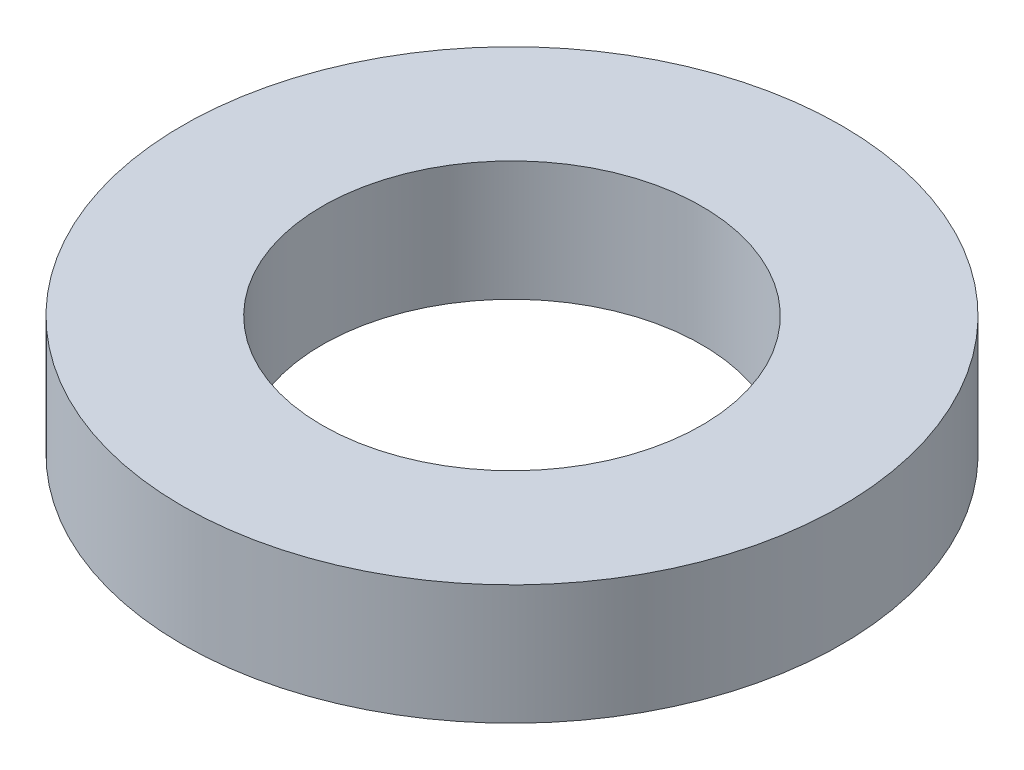
ISO-10303-21;
HEADER;
FILE_DESCRIPTION(('STEP AP214'),'2;1');
FILE_NAME('part.step','',(''),(''),'','','');
FILE_SCHEMA(('AUTOMOTIVE_DESIGN { 1 0 10303 214 1 1 1 1 }'));
ENDSEC;
DATA;
#1=APPLICATION_CONTEXT('core data for automotive mechanical design processes');
#2=APPLICATION_PROTOCOL_DEFINITION('international standard','automotive_design',2000,#1);
#3=PRODUCT_CONTEXT('',#1,'mechanical');
#4=PRODUCT('Part','Part','',(#3));
#5=PRODUCT_RELATED_PRODUCT_CATEGORY('part','',(#4));
#6=PRODUCT_DEFINITION_FORMATION('','',#4);
#7=PRODUCT_DEFINITION_CONTEXT('part definition',#1,'design');
#8=PRODUCT_DEFINITION('design','',#6,#7);
#9=PRODUCT_DEFINITION_SHAPE('','',#8);
#10=(LENGTH_UNIT() NAMED_UNIT(*) SI_UNIT(.MILLI.,.METRE.));
#11=(NAMED_UNIT(*) PLANE_ANGLE_UNIT() SI_UNIT($,.RADIAN.));
#12=(NAMED_UNIT(*) SI_UNIT($,.STERADIAN.) SOLID_ANGLE_UNIT());
#13=UNCERTAINTY_MEASURE_WITH_UNIT(LENGTH_MEASURE(1.E-05),#10,'distance_accuracy_value','');
#14=(GEOMETRIC_REPRESENTATION_CONTEXT(3) GLOBAL_UNCERTAINTY_ASSIGNED_CONTEXT((#13)) GLOBAL_UNIT_ASSIGNED_CONTEXT((#10,
#11,#12)) REPRESENTATION_CONTEXT('',''));
#15=CARTESIAN_POINT('',(0.,0.,0.));
#16=DIRECTION('',(0.,0.,1.));
#17=DIRECTION('',(1.,0.,0.));
#18=AXIS2_PLACEMENT_3D('',#15,#16,#17);
#19=CARTESIAN_POINT('',(0.,30.,0.));
#20=DIRECTION('',(0.,-1.,0.));
#21=DIRECTION('',(0.,0.,-1.));
#22=AXIS2_PLACEMENT_3D('',#19,#20,#21);
#23=CYLINDRICAL_SURFACE('',#22,82.5);
#24=CARTESIAN_POINT('',(0.,30.,0.));
#25=DIRECTION('',(0.,1.,0.));
#26=DIRECTION('',(0.,0.,1.));
#27=AXIS2_PLACEMENT_3D('',#24,#25,#26);
#28=CIRCLE('',#27,82.5);
#29=CARTESIAN_POINT('',(0.,30.,82.5));
#30=VERTEX_POINT('',#29);
#31=EDGE_CURVE('E10',#30,#30,#28,.T.);
#32=ORIENTED_EDGE('',*,*,#31,.F.);
#33=EDGE_LOOP('',(#32));
#34=FACE_BOUND('',#33,.T.);
#35=CARTESIAN_POINT('',(0.,0.,0.));
#36=DIRECTION('',(0.,1.,0.));
#37=DIRECTION('',(0.,0.,1.));
#38=AXIS2_PLACEMENT_3D('',#35,#36,#37);
#39=CIRCLE('',#38,82.5);
#40=CARTESIAN_POINT('',(0.,0.,82.5));
#41=VERTEX_POINT('',#40);
#42=EDGE_CURVE('E37',#41,#41,#39,.T.);
#43=ORIENTED_EDGE('',*,*,#42,.T.);
#44=EDGE_LOOP('',(#43));
#45=FACE_BOUND('',#44,.T.);
#46=ADVANCED_FACE('F40',(#34,#45),#23,.T.);
#47=CARTESIAN_POINT('',(0.,30.,0.));
#48=DIRECTION('',(0.,1.,0.));
#49=DIRECTION('',(0.,0.,1.));
#50=AXIS2_PLACEMENT_3D('',#47,#48,#49);
#51=PLANE('',#50);
#52=CARTESIAN_POINT('',(0.,30.,0.));
#53=DIRECTION('',(0.,1.,0.));
#54=DIRECTION('',(0.,0.,1.));
#55=AXIS2_PLACEMENT_3D('',#52,#53,#54);
#56=CIRCLE('',#55,47.5);
#57=CARTESIAN_POINT('',(0.,30.,47.5));
#58=VERTEX_POINT('',#57);
#59=EDGE_CURVE('E50',#58,#58,#56,.T.);
#60=ORIENTED_EDGE('',*,*,#59,.F.);
#61=EDGE_LOOP('',(#60));
#62=FACE_BOUND('',#61,.T.);
#63=ORIENTED_EDGE('',*,*,#31,.T.);
#64=EDGE_LOOP('',(#63));
#65=FACE_BOUND('',#64,.T.);
#66=ADVANCED_FACE('F59',(#62,#65),#51,.T.);
#67=CARTESIAN_POINT('',(0.,0.,0.));
#68=DIRECTION('',(0.,1.,0.));
#69=DIRECTION('',(0.,0.,1.));
#70=AXIS2_PLACEMENT_3D('',#67,#68,#69);
#71=PLANE('',#70);
#72=CARTESIAN_POINT('',(0.,0.,0.));
#73=DIRECTION('',(0.,1.,0.));
#74=DIRECTION('',(0.,0.,1.));
#75=AXIS2_PLACEMENT_3D('',#72,#73,#74);
#76=CIRCLE('',#75,47.5);
#77=CARTESIAN_POINT('',(0.,0.,47.5));
#78=VERTEX_POINT('',#77);
#79=EDGE_CURVE('E47',#78,#78,#76,.T.);
#80=ORIENTED_EDGE('',*,*,#79,.T.);
#81=EDGE_LOOP('',(#80));
#82=FACE_BOUND('',#81,.T.);
#83=ORIENTED_EDGE('',*,*,#42,.F.);
#84=EDGE_LOOP('',(#83));
#85=FACE_BOUND('',#84,.T.);
#86=ADVANCED_FACE('F58',(#82,#85),#71,.F.);
#87=CARTESIAN_POINT('',(0.,30.,0.));
#88=DIRECTION('',(0.,-1.,0.));
#89=DIRECTION('',(0.,0.,-1.));
#90=AXIS2_PLACEMENT_3D('',#87,#88,#89);
#91=CYLINDRICAL_SURFACE('',#90,47.5);
#92=ORIENTED_EDGE('',*,*,#59,.T.);
#93=EDGE_LOOP('',(#92));
#94=FACE_BOUND('',#93,.T.);
#95=ORIENTED_EDGE('',*,*,#79,.F.);
#96=EDGE_LOOP('',(#95));
#97=FACE_BOUND('',#96,.T.);
#98=ADVANCED_FACE('F54',(#94,#97),#91,.F.);
#99=CLOSED_SHELL('',(#46,#66,#86,#98));
#100=MANIFOLD_SOLID_BREP('B2',#99);
#101=ADVANCED_BREP_SHAPE_REPRESENTATION('',(#18,#100),#14);
#102=SHAPE_DEFINITION_REPRESENTATION(#9,#101);
ENDSEC;
END-ISO-10303-21;
